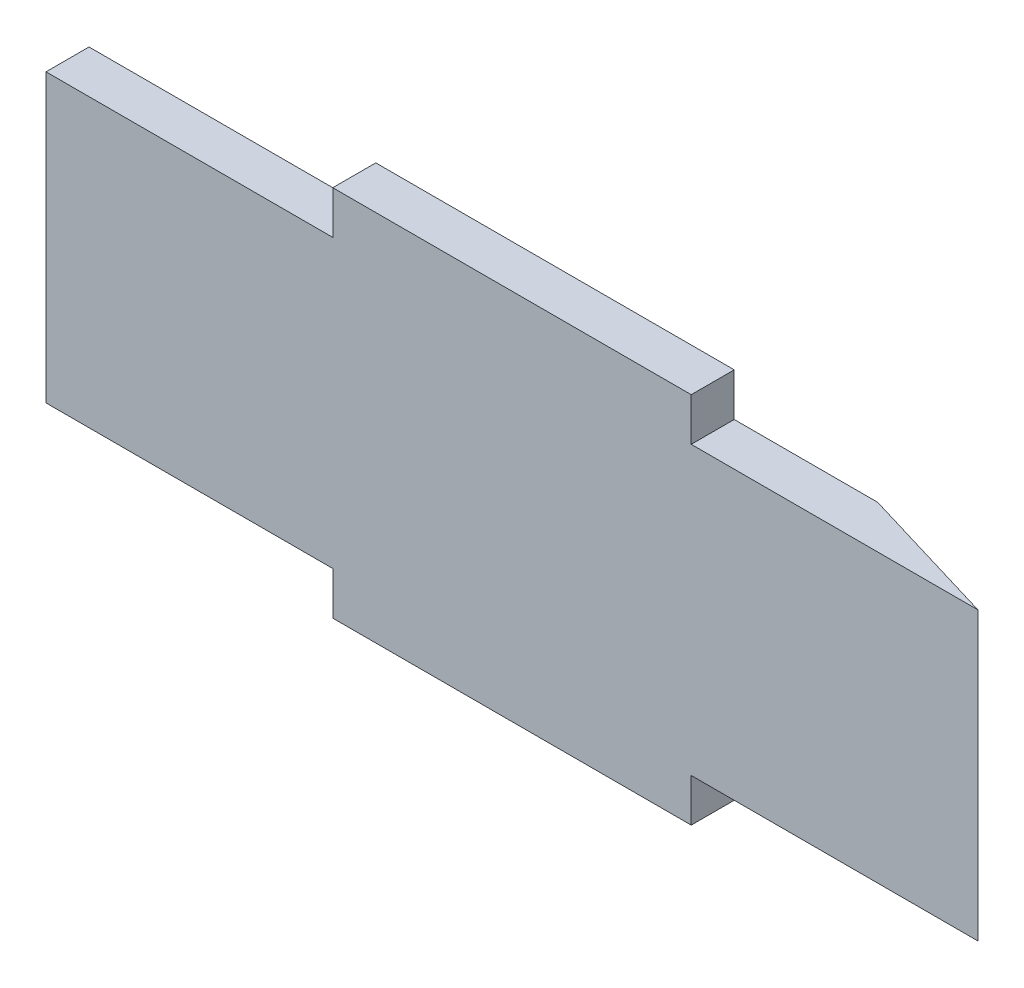
ISO-10303-21;
HEADER;
FILE_DESCRIPTION(('STEP AP214'),'2;1');
FILE_NAME('part.step','',(''),(''),'','','');
FILE_SCHEMA(('AUTOMOTIVE_DESIGN { 1 0 10303 214 1 1 1 1 }'));
ENDSEC;
DATA;
#1=APPLICATION_CONTEXT('core data for automotive mechanical design processes');
#2=APPLICATION_PROTOCOL_DEFINITION('international standard','automotive_design',2000,#1);
#3=PRODUCT_CONTEXT('',#1,'mechanical');
#4=PRODUCT('Part','Part','',(#3));
#5=PRODUCT_RELATED_PRODUCT_CATEGORY('part','',(#4));
#6=PRODUCT_DEFINITION_FORMATION('','',#4);
#7=PRODUCT_DEFINITION_CONTEXT('part definition',#1,'design');
#8=PRODUCT_DEFINITION('design','',#6,#7);
#9=PRODUCT_DEFINITION_SHAPE('','',#8);
#10=(LENGTH_UNIT() NAMED_UNIT(*) SI_UNIT(.MILLI.,.METRE.));
#11=(NAMED_UNIT(*) PLANE_ANGLE_UNIT() SI_UNIT($,.RADIAN.));
#12=(NAMED_UNIT(*) SI_UNIT($,.STERADIAN.) SOLID_ANGLE_UNIT());
#13=UNCERTAINTY_MEASURE_WITH_UNIT(LENGTH_MEASURE(1.E-05),#10,'distance_accuracy_value','');
#14=(GEOMETRIC_REPRESENTATION_CONTEXT(3) GLOBAL_UNCERTAINTY_ASSIGNED_CONTEXT((#13)) GLOBAL_UNIT_ASSIGNED_CONTEXT((#10,
#11,#12)) REPRESENTATION_CONTEXT('',''));
#15=CARTESIAN_POINT('',(0.,0.,0.));
#16=DIRECTION('',(0.,0.,1.));
#17=DIRECTION('',(1.,0.,0.));
#18=AXIS2_PLACEMENT_3D('',#15,#16,#17);
#19=CARTESIAN_POINT('',(65.,-20.,6.));
#20=DIRECTION('',(0.,1.,0.));
#21=DIRECTION('',(-1.,0.,0.));
#22=AXIS2_PLACEMENT_3D('',#19,#20,#21);
#23=PLANE('',#22);
#24=DIRECTION('',(0.,0.,-1.));
#25=VECTOR('',#24,1.);
#26=CARTESIAN_POINT('',(-25.,-20.,6.));
#27=LINE('',#26,#25);
#28=CARTESIAN_POINT('',(-25.,-20.,6.));
#29=VERTEX_POINT('',#28);
#30=CARTESIAN_POINT('',(-25.,-20.,0.));
#31=VERTEX_POINT('',#30);
#32=EDGE_CURVE('E200',#29,#31,#27,.T.);
#33=ORIENTED_EDGE('',*,*,#32,.F.);
#34=DIRECTION('',(1.,0.,0.));
#35=VECTOR('',#34,1.);
#36=CARTESIAN_POINT('',(65.,-20.,6.));
#37=LINE('',#36,#35);
#38=CARTESIAN_POINT('',(-65.,-20.,6.));
#39=VERTEX_POINT('',#38);
#40=EDGE_CURVE('E129',#39,#29,#37,.T.);
#41=ORIENTED_EDGE('',*,*,#40,.F.);
#42=DIRECTION('',(0.,0.,-1.));
#43=VECTOR('',#42,1.);
#44=CARTESIAN_POINT('',(-65.,-20.,6.));
#45=LINE('',#44,#43);
#46=CARTESIAN_POINT('',(-65.,-20.,0.));
#47=VERTEX_POINT('',#46);
#48=EDGE_CURVE('E42',#39,#47,#45,.T.);
#49=ORIENTED_EDGE('',*,*,#48,.T.);
#50=DIRECTION('',(1.,0.,0.));
#51=VECTOR('',#50,1.);
#52=CARTESIAN_POINT('',(65.,-20.,0.));
#53=LINE('',#52,#51);
#54=EDGE_CURVE('E159',#47,#31,#53,.T.);
#55=ORIENTED_EDGE('',*,*,#54,.T.);
#56=EDGE_LOOP('',(#33,#41,#49,#55));
#57=FACE_BOUND('',#56,.T.);
#58=ADVANCED_FACE('F34',(#57),#23,.F.);
#59=CARTESIAN_POINT('',(65.,20.,6.));
#60=DIRECTION('',(0.,-1.,0.));
#61=DIRECTION('',(1.,0.,0.));
#62=AXIS2_PLACEMENT_3D('',#59,#60,#61);
#63=PLANE('',#62);
#64=DIRECTION('',(-1.,0.,0.));
#65=VECTOR('',#64,1.);
#66=CARTESIAN_POINT('',(65.,20.,6.));
#67=LINE('',#66,#65);
#68=CARTESIAN_POINT('',(65.,20.,6.));
#69=VERTEX_POINT('',#68);
#70=CARTESIAN_POINT('',(25.,20.,6.));
#71=VERTEX_POINT('',#70);
#72=EDGE_CURVE('E152',#69,#71,#67,.T.);
#73=ORIENTED_EDGE('',*,*,#72,.F.);
#74=DIRECTION('',(-0.957826285221151,0.,-0.287347885566346));
#75=VECTOR('',#74,1.);
#76=CARTESIAN_POINT('',(65.,20.,6.));
#77=LINE('',#76,#75);
#78=CARTESIAN_POINT('',(45.,20.,0.));
#79=VERTEX_POINT('',#78);
#80=EDGE_CURVE('E123',#69,#79,#77,.T.);
#81=ORIENTED_EDGE('',*,*,#80,.T.);
#82=DIRECTION('',(-1.,0.,0.));
#83=VECTOR('',#82,1.);
#84=CARTESIAN_POINT('',(65.,20.,0.));
#85=LINE('',#84,#83);
#86=CARTESIAN_POINT('',(25.,20.,0.));
#87=VERTEX_POINT('',#86);
#88=EDGE_CURVE('E148',#79,#87,#85,.T.);
#89=ORIENTED_EDGE('',*,*,#88,.T.);
#90=DIRECTION('',(0.,0.,-1.));
#91=VECTOR('',#90,1.);
#92=CARTESIAN_POINT('',(25.,20.,6.));
#93=LINE('',#92,#91);
#94=EDGE_CURVE('E220',#71,#87,#93,.T.);
#95=ORIENTED_EDGE('',*,*,#94,.F.);
#96=EDGE_LOOP('',(#73,#81,#89,#95));
#97=FACE_BOUND('',#96,.T.);
#98=ADVANCED_FACE('F238',(#97),#63,.F.);
#99=CARTESIAN_POINT('',(-65.,20.,6.));
#100=DIRECTION('',(1.,0.,0.));
#101=DIRECTION('',(0.,1.,0.));
#102=AXIS2_PLACEMENT_3D('',#99,#100,#101);
#103=PLANE('',#102);
#104=DIRECTION('',(0.,-1.,0.));
#105=VECTOR('',#104,1.);
#106=CARTESIAN_POINT('',(-65.,20.,0.));
#107=LINE('',#106,#105);
#108=CARTESIAN_POINT('',(-65.,20.,0.));
#109=VERTEX_POINT('',#108);
#110=EDGE_CURVE('E155',#109,#47,#107,.T.);
#111=ORIENTED_EDGE('',*,*,#110,.T.);
#112=ORIENTED_EDGE('',*,*,#48,.F.);
#113=DIRECTION('',(0.,-1.,0.));
#114=VECTOR('',#113,1.);
#115=CARTESIAN_POINT('',(-65.,20.,6.));
#116=LINE('',#115,#114);
#117=CARTESIAN_POINT('',(-65.,20.,6.));
#118=VERTEX_POINT('',#117);
#119=EDGE_CURVE('E145',#118,#39,#116,.T.);
#120=ORIENTED_EDGE('',*,*,#119,.F.);
#121=DIRECTION('',(0.,0.,-1.));
#122=VECTOR('',#121,1.);
#123=CARTESIAN_POINT('',(-65.,20.,6.));
#124=LINE('',#123,#122);
#125=EDGE_CURVE('E154',#118,#109,#124,.T.);
#126=ORIENTED_EDGE('',*,*,#125,.T.);
#127=EDGE_LOOP('',(#111,#112,#120,#126));
#128=FACE_BOUND('',#127,.T.);
#129=ADVANCED_FACE('F36',(#128),#103,.F.);
#130=CARTESIAN_POINT('',(25.,-20.,0.));
#131=VERTEX_POINT('',#130);
#132=CARTESIAN_POINT('',(45.,-20.,0.));
#133=VERTEX_POINT('',#132);
#134=EDGE_CURVE('E137',#131,#133,#53,.T.);
#135=ORIENTED_EDGE('',*,*,#134,.T.);
#136=DIRECTION('',(-0.957826285221151,0.,-0.287347885566346));
#137=VECTOR('',#136,1.);
#138=CARTESIAN_POINT('',(65.,-20.,6.));
#139=LINE('',#138,#137);
#140=CARTESIAN_POINT('',(65.,-20.,6.));
#141=VERTEX_POINT('',#140);
#142=EDGE_CURVE('E48',#141,#133,#139,.T.);
#143=ORIENTED_EDGE('',*,*,#142,.F.);
#144=CARTESIAN_POINT('',(25.,-20.,6.));
#145=VERTEX_POINT('',#144);
#146=EDGE_CURVE('E135',#145,#141,#37,.T.);
#147=ORIENTED_EDGE('',*,*,#146,.F.);
#148=DIRECTION('',(0.,0.,-1.));
#149=VECTOR('',#148,1.);
#150=CARTESIAN_POINT('',(25.,-20.,6.));
#151=LINE('',#150,#149);
#152=EDGE_CURVE('E198',#145,#131,#151,.T.);
#153=ORIENTED_EDGE('',*,*,#152,.T.);
#154=EDGE_LOOP('',(#135,#143,#147,#153));
#155=FACE_BOUND('',#154,.T.);
#156=ADVANCED_FACE('F134',(#155),#23,.F.);
#157=CARTESIAN_POINT('',(-25.,20.,6.));
#158=VERTEX_POINT('',#157);
#159=EDGE_CURVE('E128',#158,#118,#67,.T.);
#160=ORIENTED_EDGE('',*,*,#159,.F.);
#161=DIRECTION('',(0.,0.,-1.));
#162=VECTOR('',#161,1.);
#163=CARTESIAN_POINT('',(-25.,20.,6.));
#164=LINE('',#163,#162);
#165=CARTESIAN_POINT('',(-25.,20.,0.));
#166=VERTEX_POINT('',#165);
#167=EDGE_CURVE('E158',#158,#166,#164,.T.);
#168=ORIENTED_EDGE('',*,*,#167,.T.);
#169=EDGE_CURVE('E162',#166,#109,#85,.T.);
#170=ORIENTED_EDGE('',*,*,#169,.T.);
#171=ORIENTED_EDGE('',*,*,#125,.F.);
#172=EDGE_LOOP('',(#160,#168,#170,#171));
#173=FACE_BOUND('',#172,.T.);
#174=ADVANCED_FACE('F241',(#173),#63,.F.);
#175=CARTESIAN_POINT('',(0.,0.,6.));
#176=DIRECTION('',(0.,0.,-1.));
#177=DIRECTION('',(-1.,0.,0.));
#178=AXIS2_PLACEMENT_3D('',#175,#176,#177);
#179=PLANE('',#178);
#180=ORIENTED_EDGE('',*,*,#119,.T.);
#181=ORIENTED_EDGE('',*,*,#40,.T.);
#182=DIRECTION('',(0.,1.,0.));
#183=VECTOR('',#182,1.);
#184=CARTESIAN_POINT('',(-25.,-20.,6.));
#185=LINE('',#184,#183);
#186=CARTESIAN_POINT('',(-25.,-26.,6.));
#187=VERTEX_POINT('',#186);
#188=EDGE_CURVE('E192',#187,#29,#185,.T.);
#189=ORIENTED_EDGE('',*,*,#188,.F.);
#190=DIRECTION('',(-1.,0.,0.));
#191=VECTOR('',#190,1.);
#192=CARTESIAN_POINT('',(-25.,-26.,6.));
#193=LINE('',#192,#191);
#194=CARTESIAN_POINT('',(25.,-26.,6.));
#195=VERTEX_POINT('',#194);
#196=EDGE_CURVE('E188',#195,#187,#193,.T.);
#197=ORIENTED_EDGE('',*,*,#196,.F.);
#198=DIRECTION('',(0.,-1.,0.));
#199=VECTOR('',#198,1.);
#200=CARTESIAN_POINT('',(25.,-20.,6.));
#201=LINE('',#200,#199);
#202=EDGE_CURVE('E144',#145,#195,#201,.T.);
#203=ORIENTED_EDGE('',*,*,#202,.F.);
#204=ORIENTED_EDGE('',*,*,#146,.T.);
#205=DIRECTION('',(0.,1.,0.));
#206=VECTOR('',#205,1.);
#207=CARTESIAN_POINT('',(65.,20.,6.));
#208=LINE('',#207,#206);
#209=EDGE_CURVE('E120',#141,#69,#208,.T.);
#210=ORIENTED_EDGE('',*,*,#209,.T.);
#211=ORIENTED_EDGE('',*,*,#72,.T.);
#212=DIRECTION('',(0.,-1.,0.));
#213=VECTOR('',#212,1.);
#214=CARTESIAN_POINT('',(25.,20.,6.));
#215=LINE('',#214,#213);
#216=CARTESIAN_POINT('',(25.,26.,6.));
#217=VERTEX_POINT('',#216);
#218=EDGE_CURVE('E209',#217,#71,#215,.T.);
#219=ORIENTED_EDGE('',*,*,#218,.F.);
#220=DIRECTION('',(1.,0.,0.));
#221=VECTOR('',#220,1.);
#222=CARTESIAN_POINT('',(-25.,26.,6.));
#223=LINE('',#222,#221);
#224=CARTESIAN_POINT('',(-25.,26.,6.));
#225=VERTEX_POINT('',#224);
#226=EDGE_CURVE('E205',#225,#217,#223,.T.);
#227=ORIENTED_EDGE('',*,*,#226,.F.);
#228=DIRECTION('',(0.,1.,0.));
#229=VECTOR('',#228,1.);
#230=CARTESIAN_POINT('',(-25.,20.,6.));
#231=LINE('',#230,#229);
#232=EDGE_CURVE('E202',#158,#225,#231,.T.);
#233=ORIENTED_EDGE('',*,*,#232,.F.);
#234=ORIENTED_EDGE('',*,*,#159,.T.);
#235=EDGE_LOOP('',(#180,#181,#189,#197,#203,#204,#210,#211,#219,#227,#233,#234));
#236=FACE_BOUND('',#235,.T.);
#237=ADVANCED_FACE('F141',(#236),#179,.F.);
#238=CARTESIAN_POINT('',(0.,0.,0.));
#239=DIRECTION('',(0.,0.,-1.));
#240=DIRECTION('',(-1.,0.,0.));
#241=AXIS2_PLACEMENT_3D('',#238,#239,#240);
#242=PLANE('',#241);
#243=DIRECTION('',(0.,1.,0.));
#244=VECTOR('',#243,1.);
#245=CARTESIAN_POINT('',(45.,0.,0.));
#246=LINE('',#245,#244);
#247=EDGE_CURVE('E11',#133,#79,#246,.T.);
#248=ORIENTED_EDGE('',*,*,#247,.F.);
#249=ORIENTED_EDGE('',*,*,#134,.F.);
#250=DIRECTION('',(0.,-1.,0.));
#251=VECTOR('',#250,1.);
#252=CARTESIAN_POINT('',(25.,-20.,0.));
#253=LINE('',#252,#251);
#254=CARTESIAN_POINT('',(25.,-26.,0.));
#255=VERTEX_POINT('',#254);
#256=EDGE_CURVE('E56',#131,#255,#253,.T.);
#257=ORIENTED_EDGE('',*,*,#256,.T.);
#258=DIRECTION('',(-1.,0.,0.));
#259=VECTOR('',#258,1.);
#260=CARTESIAN_POINT('',(-25.,-26.,0.));
#261=LINE('',#260,#259);
#262=CARTESIAN_POINT('',(-25.,-26.,0.));
#263=VERTEX_POINT('',#262);
#264=EDGE_CURVE('E182',#255,#263,#261,.T.);
#265=ORIENTED_EDGE('',*,*,#264,.T.);
#266=DIRECTION('',(0.,1.,0.));
#267=VECTOR('',#266,1.);
#268=CARTESIAN_POINT('',(-25.,-20.,0.));
#269=LINE('',#268,#267);
#270=EDGE_CURVE('E180',#263,#31,#269,.T.);
#271=ORIENTED_EDGE('',*,*,#270,.T.);
#272=ORIENTED_EDGE('',*,*,#54,.F.);
#273=ORIENTED_EDGE('',*,*,#110,.F.);
#274=ORIENTED_EDGE('',*,*,#169,.F.);
#275=DIRECTION('',(0.,1.,0.));
#276=VECTOR('',#275,1.);
#277=CARTESIAN_POINT('',(-25.,20.,0.));
#278=LINE('',#277,#276);
#279=CARTESIAN_POINT('',(-25.,26.,0.));
#280=VERTEX_POINT('',#279);
#281=EDGE_CURVE('E195',#166,#280,#278,.T.);
#282=ORIENTED_EDGE('',*,*,#281,.T.);
#283=DIRECTION('',(1.,0.,0.));
#284=VECTOR('',#283,1.);
#285=CARTESIAN_POINT('',(-25.,26.,0.));
#286=LINE('',#285,#284);
#287=CARTESIAN_POINT('',(25.,26.,0.));
#288=VERTEX_POINT('',#287);
#289=EDGE_CURVE('E213',#280,#288,#286,.T.);
#290=ORIENTED_EDGE('',*,*,#289,.T.);
#291=DIRECTION('',(0.,-1.,0.));
#292=VECTOR('',#291,1.);
#293=CARTESIAN_POINT('',(25.,20.,0.));
#294=LINE('',#293,#292);
#295=EDGE_CURVE('E206',#288,#87,#294,.T.);
#296=ORIENTED_EDGE('',*,*,#295,.T.);
#297=ORIENTED_EDGE('',*,*,#88,.F.);
#298=EDGE_LOOP('',(#248,#249,#257,#265,#271,#272,#273,#274,#282,#290,#296,#297));
#299=FACE_BOUND('',#298,.T.);
#300=ADVANCED_FACE('F175',(#299),#242,.T.);
#301=CARTESIAN_POINT('',(-25.,20.,6.));
#302=DIRECTION('',(-1.,0.,0.));
#303=DIRECTION('',(0.,-1.,0.));
#304=AXIS2_PLACEMENT_3D('',#301,#302,#303);
#305=PLANE('',#304);
#306=ORIENTED_EDGE('',*,*,#281,.F.);
#307=ORIENTED_EDGE('',*,*,#167,.F.);
#308=ORIENTED_EDGE('',*,*,#232,.T.);
#309=DIRECTION('',(0.,0.,-1.));
#310=VECTOR('',#309,1.);
#311=CARTESIAN_POINT('',(-25.,26.,6.));
#312=LINE('',#311,#310);
#313=EDGE_CURVE('E211',#225,#280,#312,.T.);
#314=ORIENTED_EDGE('',*,*,#313,.T.);
#315=EDGE_LOOP('',(#306,#307,#308,#314));
#316=FACE_BOUND('',#315,.T.);
#317=ADVANCED_FACE('F226',(#316),#305,.T.);
#318=CARTESIAN_POINT('',(25.,20.,6.));
#319=DIRECTION('',(1.,0.,0.));
#320=DIRECTION('',(0.,1.,0.));
#321=AXIS2_PLACEMENT_3D('',#318,#319,#320);
#322=PLANE('',#321);
#323=ORIENTED_EDGE('',*,*,#295,.F.);
#324=DIRECTION('',(0.,0.,-1.));
#325=VECTOR('',#324,1.);
#326=CARTESIAN_POINT('',(25.,26.,6.));
#327=LINE('',#326,#325);
#328=EDGE_CURVE('E223',#217,#288,#327,.T.);
#329=ORIENTED_EDGE('',*,*,#328,.F.);
#330=ORIENTED_EDGE('',*,*,#218,.T.);
#331=ORIENTED_EDGE('',*,*,#94,.T.);
#332=EDGE_LOOP('',(#323,#329,#330,#331));
#333=FACE_BOUND('',#332,.T.);
#334=ADVANCED_FACE('F234',(#333),#322,.T.);
#335=CARTESIAN_POINT('',(-25.,26.,6.));
#336=DIRECTION('',(0.,1.,0.));
#337=DIRECTION('',(-1.,0.,0.));
#338=AXIS2_PLACEMENT_3D('',#335,#336,#337);
#339=PLANE('',#338);
#340=ORIENTED_EDGE('',*,*,#289,.F.);
#341=ORIENTED_EDGE('',*,*,#313,.F.);
#342=ORIENTED_EDGE('',*,*,#226,.T.);
#343=ORIENTED_EDGE('',*,*,#328,.T.);
#344=EDGE_LOOP('',(#340,#341,#342,#343));
#345=FACE_BOUND('',#344,.T.);
#346=ADVANCED_FACE('F230',(#345),#339,.T.);
#347=CARTESIAN_POINT('',(-25.,-20.,6.));
#348=DIRECTION('',(-1.,0.,0.));
#349=DIRECTION('',(0.,-1.,0.));
#350=AXIS2_PLACEMENT_3D('',#347,#348,#349);
#351=PLANE('',#350);
#352=ORIENTED_EDGE('',*,*,#270,.F.);
#353=DIRECTION('',(0.,0.,-1.));
#354=VECTOR('',#353,1.);
#355=CARTESIAN_POINT('',(-25.,-26.,6.));
#356=LINE('',#355,#354);
#357=EDGE_CURVE('E193',#187,#263,#356,.T.);
#358=ORIENTED_EDGE('',*,*,#357,.F.);
#359=ORIENTED_EDGE('',*,*,#188,.T.);
#360=ORIENTED_EDGE('',*,*,#32,.T.);
#361=EDGE_LOOP('',(#352,#358,#359,#360));
#362=FACE_BOUND('',#361,.T.);
#363=ADVANCED_FACE('F255',(#362),#351,.T.);
#364=CARTESIAN_POINT('',(-25.,-26.,6.));
#365=DIRECTION('',(0.,-1.,0.));
#366=DIRECTION('',(1.,0.,0.));
#367=AXIS2_PLACEMENT_3D('',#364,#365,#366);
#368=PLANE('',#367);
#369=ORIENTED_EDGE('',*,*,#264,.F.);
#370=DIRECTION('',(0.,0.,-1.));
#371=VECTOR('',#370,1.);
#372=CARTESIAN_POINT('',(25.,-26.,6.));
#373=LINE('',#372,#371);
#374=EDGE_CURVE('E196',#195,#255,#373,.T.);
#375=ORIENTED_EDGE('',*,*,#374,.F.);
#376=ORIENTED_EDGE('',*,*,#196,.T.);
#377=ORIENTED_EDGE('',*,*,#357,.T.);
#378=EDGE_LOOP('',(#369,#375,#376,#377));
#379=FACE_BOUND('',#378,.T.);
#380=ADVANCED_FACE('F246',(#379),#368,.T.);
#381=CARTESIAN_POINT('',(25.,-20.,6.));
#382=DIRECTION('',(1.,0.,0.));
#383=DIRECTION('',(0.,1.,0.));
#384=AXIS2_PLACEMENT_3D('',#381,#382,#383);
#385=PLANE('',#384);
#386=ORIENTED_EDGE('',*,*,#256,.F.);
#387=ORIENTED_EDGE('',*,*,#152,.F.);
#388=ORIENTED_EDGE('',*,*,#202,.T.);
#389=ORIENTED_EDGE('',*,*,#374,.T.);
#390=EDGE_LOOP('',(#386,#387,#388,#389));
#391=FACE_BOUND('',#390,.T.);
#392=ADVANCED_FACE('F247',(#391),#385,.T.);
#393=CARTESIAN_POINT('',(65.,26.,6.));
#394=DIRECTION('',(-0.287347885566346,0.,0.957826285221151));
#395=DIRECTION('',(0.957826285221151,0.,0.287347885566346));
#396=AXIS2_PLACEMENT_3D('',#393,#394,#395);
#397=PLANE('',#396);
#398=ORIENTED_EDGE('',*,*,#209,.F.);
#399=ORIENTED_EDGE('',*,*,#142,.T.);
#400=ORIENTED_EDGE('',*,*,#247,.T.);
#401=ORIENTED_EDGE('',*,*,#80,.F.);
#402=EDGE_LOOP('',(#398,#399,#400,#401));
#403=FACE_BOUND('',#402,.T.);
#404=ADVANCED_FACE('F121',(#403),#397,.F.);
#405=CLOSED_SHELL('',(#58,#98,#129,#156,#174,#237,#300,#317,#334,#346,#363,#380,#392,#404));
#406=MANIFOLD_SOLID_BREP('B2',#405);
#407=ADVANCED_BREP_SHAPE_REPRESENTATION('',(#18,#406),#14);
#408=SHAPE_DEFINITION_REPRESENTATION(#9,#407);
ENDSEC;
END-ISO-10303-21;
